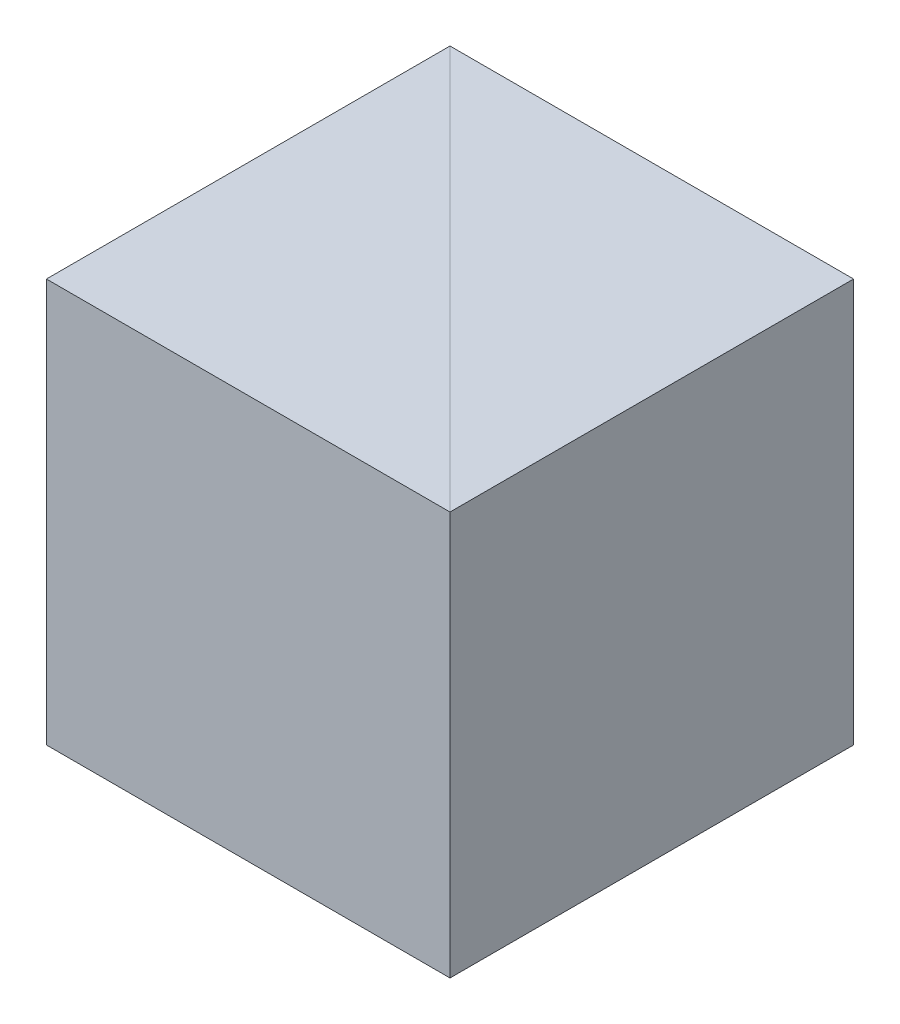
ISO-10303-21;
HEADER;
FILE_DESCRIPTION(('STEP AP214'),'2;1');
FILE_NAME('part.step','',(''),(''),'','','');
FILE_SCHEMA(('AUTOMOTIVE_DESIGN { 1 0 10303 214 1 1 1 1 }'));
ENDSEC;
DATA;
#1=APPLICATION_CONTEXT('core data for automotive mechanical design processes');
#2=APPLICATION_PROTOCOL_DEFINITION('international standard','automotive_design',2000,#1);
#3=PRODUCT_CONTEXT('',#1,'mechanical');
#4=PRODUCT('Part','Part','',(#3));
#5=PRODUCT_RELATED_PRODUCT_CATEGORY('part','',(#4));
#6=PRODUCT_DEFINITION_FORMATION('','',#4);
#7=PRODUCT_DEFINITION_CONTEXT('part definition',#1,'design');
#8=PRODUCT_DEFINITION('design','',#6,#7);
#9=PRODUCT_DEFINITION_SHAPE('','',#8);
#10=(LENGTH_UNIT() NAMED_UNIT(*) SI_UNIT(.MILLI.,.METRE.));
#11=(NAMED_UNIT(*) PLANE_ANGLE_UNIT() SI_UNIT($,.RADIAN.));
#12=(NAMED_UNIT(*) SI_UNIT($,.STERADIAN.) SOLID_ANGLE_UNIT());
#13=UNCERTAINTY_MEASURE_WITH_UNIT(LENGTH_MEASURE(1.E-05),#10,'distance_accuracy_value','');
#14=(GEOMETRIC_REPRESENTATION_CONTEXT(3) GLOBAL_UNCERTAINTY_ASSIGNED_CONTEXT((#13)) GLOBAL_UNIT_ASSIGNED_CONTEXT((#10,
#11,#12)) REPRESENTATION_CONTEXT('',''));
#15=CARTESIAN_POINT('',(0.,0.,0.));
#16=DIRECTION('',(0.,0.,1.));
#17=DIRECTION('',(1.,0.,0.));
#18=AXIS2_PLACEMENT_3D('',#15,#16,#17);
#19=CARTESIAN_POINT('',(0.,10.,0.));
#20=DIRECTION('',(0.707106781186547,0.,-0.707106781186548));
#21=DIRECTION('',(-0.707106781186548,0.,-0.707106781186547));
#22=AXIS2_PLACEMENT_3D('',#19,#20,#21);
#23=PLANE('',#22);
#24=DIRECTION('',(0.707106781186548,0.,0.707106781186547));
#25=VECTOR('',#24,1.);
#26=CARTESIAN_POINT('',(0.,0.,0.));
#27=LINE('',#26,#25);
#28=CARTESIAN_POINT('',(-10.,0.,-10.));
#29=VERTEX_POINT('',#28);
#30=CARTESIAN_POINT('',(0.,0.,0.));
#31=VERTEX_POINT('',#30);
#32=EDGE_CURVE('E97',#29,#31,#27,.T.);
#33=ORIENTED_EDGE('',*,*,#32,.F.);
#34=DIRECTION('',(0.,-1.,0.));
#35=VECTOR('',#34,1.);
#36=CARTESIAN_POINT('',(-10.,10.,-10.));
#37=LINE('',#36,#35);
#38=CARTESIAN_POINT('',(-10.,10.,-10.));
#39=VERTEX_POINT('',#38);
#40=EDGE_CURVE('E12',#39,#29,#37,.T.);
#41=ORIENTED_EDGE('',*,*,#40,.F.);
#42=DIRECTION('',(0.707106781186548,0.,0.707106781186547));
#43=VECTOR('',#42,1.);
#44=CARTESIAN_POINT('',(0.,10.,0.));
#45=LINE('',#44,#43);
#46=CARTESIAN_POINT('',(0.,10.,0.));
#47=VERTEX_POINT('',#46);
#48=EDGE_CURVE('E89',#39,#47,#45,.T.);
#49=ORIENTED_EDGE('',*,*,#48,.T.);
#50=DIRECTION('',(0.,-1.,0.));
#51=VECTOR('',#50,1.);
#52=CARTESIAN_POINT('',(0.,10.,0.));
#53=LINE('',#52,#51);
#54=EDGE_CURVE('E48',#47,#31,#53,.T.);
#55=ORIENTED_EDGE('',*,*,#54,.T.);
#56=EDGE_LOOP('',(#33,#41,#49,#55));
#57=FACE_BOUND('',#56,.T.);
#58=ADVANCED_FACE('F45',(#57),#23,.T.);
#59=CARTESIAN_POINT('',(-10.,10.,-10.));
#60=DIRECTION('',(-1.,0.,0.));
#61=DIRECTION('',(0.,0.,1.));
#62=AXIS2_PLACEMENT_3D('',#59,#60,#61);
#63=PLANE('',#62);
#64=DIRECTION('',(0.,0.,-1.));
#65=VECTOR('',#64,1.);
#66=CARTESIAN_POINT('',(-10.,0.,-10.));
#67=LINE('',#66,#65);
#68=CARTESIAN_POINT('',(-10.,0.,0.));
#69=VERTEX_POINT('',#68);
#70=EDGE_CURVE('E91',#69,#29,#67,.T.);
#71=ORIENTED_EDGE('',*,*,#70,.F.);
#72=DIRECTION('',(0.,-1.,0.));
#73=VECTOR('',#72,1.);
#74=CARTESIAN_POINT('',(-10.,10.,0.));
#75=LINE('',#74,#73);
#76=CARTESIAN_POINT('',(-10.,10.,0.));
#77=VERTEX_POINT('',#76);
#78=EDGE_CURVE('E54',#77,#69,#75,.T.);
#79=ORIENTED_EDGE('',*,*,#78,.F.);
#80=DIRECTION('',(0.,0.,-1.));
#81=VECTOR('',#80,1.);
#82=CARTESIAN_POINT('',(-10.,10.,-10.));
#83=LINE('',#82,#81);
#84=EDGE_CURVE('E86',#77,#39,#83,.T.);
#85=ORIENTED_EDGE('',*,*,#84,.T.);
#86=ORIENTED_EDGE('',*,*,#40,.T.);
#87=EDGE_LOOP('',(#71,#79,#85,#86));
#88=FACE_BOUND('',#87,.T.);
#89=ADVANCED_FACE('F101',(#88),#63,.T.);
#90=CARTESIAN_POINT('',(-10.,10.,0.));
#91=DIRECTION('',(0.,0.,1.));
#92=DIRECTION('',(1.,0.,0.));
#93=AXIS2_PLACEMENT_3D('',#90,#91,#92);
#94=PLANE('',#93);
#95=DIRECTION('',(-1.,0.,0.));
#96=VECTOR('',#95,1.);
#97=CARTESIAN_POINT('',(-10.,0.,0.));
#98=LINE('',#97,#96);
#99=EDGE_CURVE('E84',#31,#69,#98,.T.);
#100=ORIENTED_EDGE('',*,*,#99,.F.);
#101=ORIENTED_EDGE('',*,*,#54,.F.);
#102=DIRECTION('',(-1.,0.,0.));
#103=VECTOR('',#102,1.);
#104=CARTESIAN_POINT('',(-10.,10.,0.));
#105=LINE('',#104,#103);
#106=EDGE_CURVE('E82',#47,#77,#105,.T.);
#107=ORIENTED_EDGE('',*,*,#106,.T.);
#108=ORIENTED_EDGE('',*,*,#78,.T.);
#109=EDGE_LOOP('',(#100,#101,#107,#108));
#110=FACE_BOUND('',#109,.T.);
#111=ADVANCED_FACE('F81',(#110),#94,.T.);
#112=CARTESIAN_POINT('',(0.,10.,0.));
#113=DIRECTION('',(0.,1.,0.));
#114=DIRECTION('',(0.,0.,1.));
#115=AXIS2_PLACEMENT_3D('',#112,#113,#114);
#116=PLANE('',#115);
#117=ORIENTED_EDGE('',*,*,#48,.F.);
#118=ORIENTED_EDGE('',*,*,#84,.F.);
#119=ORIENTED_EDGE('',*,*,#106,.F.);
#120=EDGE_LOOP('',(#117,#118,#119));
#121=FACE_BOUND('',#120,.T.);
#122=ADVANCED_FACE('F88',(#121),#116,.T.);
#123=CARTESIAN_POINT('',(0.,0.,0.));
#124=DIRECTION('',(0.,1.,0.));
#125=DIRECTION('',(0.,0.,1.));
#126=AXIS2_PLACEMENT_3D('',#123,#124,#125);
#127=PLANE('',#126);
#128=ORIENTED_EDGE('',*,*,#32,.T.);
#129=ORIENTED_EDGE('',*,*,#99,.T.);
#130=ORIENTED_EDGE('',*,*,#70,.T.);
#131=EDGE_LOOP('',(#128,#129,#130));
#132=FACE_BOUND('',#131,.T.);
#133=ADVANCED_FACE('F100',(#132),#127,.F.);
#134=CLOSED_SHELL('',(#58,#89,#111,#122,#133));
#135=MANIFOLD_SOLID_BREP('B2',#134);
#136=CARTESIAN_POINT('',(-10.,10.,-10.));
#137=DIRECTION('',(0.707106781186547,0.,-0.707106781186548));
#138=DIRECTION('',(-0.707106781186548,0.,-0.707106781186547));
#139=AXIS2_PLACEMENT_3D('',#136,#137,#138);
#140=PLANE('',#139);
#141=DIRECTION('',(0.707106781186548,0.,0.707106781186547));
#142=VECTOR('',#141,1.);
#143=CARTESIAN_POINT('',(-10.,0.,-10.));
#144=LINE('',#143,#142);
#145=CARTESIAN_POINT('',(-10.,0.,-10.));
#146=VERTEX_POINT('',#145);
#147=CARTESIAN_POINT('',(0.,0.,0.));
#148=VERTEX_POINT('',#147);
#149=EDGE_CURVE('E190',#146,#148,#144,.T.);
#150=ORIENTED_EDGE('',*,*,#149,.T.);
#151=DIRECTION('',(0.,-1.,0.));
#152=VECTOR('',#151,1.);
#153=CARTESIAN_POINT('',(0.,10.,0.));
#154=LINE('',#153,#152);
#155=CARTESIAN_POINT('',(0.,10.,0.));
#156=VERTEX_POINT('',#155);
#157=EDGE_CURVE('E43',#156,#148,#154,.T.);
#158=ORIENTED_EDGE('',*,*,#157,.F.);
#159=DIRECTION('',(0.707106781186548,0.,0.707106781186547));
#160=VECTOR('',#159,1.);
#161=CARTESIAN_POINT('',(-10.,10.,-10.));
#162=LINE('',#161,#160);
#163=CARTESIAN_POINT('',(-10.,10.,-10.));
#164=VERTEX_POINT('',#163);
#165=EDGE_CURVE('E183',#164,#156,#162,.T.);
#166=ORIENTED_EDGE('',*,*,#165,.F.);
#167=DIRECTION('',(0.,-1.,0.));
#168=VECTOR('',#167,1.);
#169=CARTESIAN_POINT('',(-10.,10.,-10.));
#170=LINE('',#169,#168);
#171=EDGE_CURVE('E191',#164,#146,#170,.T.);
#172=ORIENTED_EDGE('',*,*,#171,.T.);
#173=EDGE_LOOP('',(#150,#158,#166,#172));
#174=FACE_BOUND('',#173,.T.);
#175=ADVANCED_FACE('F143',(#174),#140,.F.);
#176=CARTESIAN_POINT('',(0.,10.,0.));
#177=DIRECTION('',(-1.,0.,0.));
#178=DIRECTION('',(0.,0.,1.));
#179=AXIS2_PLACEMENT_3D('',#176,#177,#178);
#180=PLANE('',#179);
#181=DIRECTION('',(0.,0.,-1.));
#182=VECTOR('',#181,1.);
#183=CARTESIAN_POINT('',(0.,0.,0.));
#184=LINE('',#183,#182);
#185=CARTESIAN_POINT('',(0.,0.,-10.));
#186=VERTEX_POINT('',#185);
#187=EDGE_CURVE('E171',#148,#186,#184,.T.);
#188=ORIENTED_EDGE('',*,*,#187,.T.);
#189=DIRECTION('',(0.,-1.,0.));
#190=VECTOR('',#189,1.);
#191=CARTESIAN_POINT('',(0.,10.,-10.));
#192=LINE('',#191,#190);
#193=CARTESIAN_POINT('',(0.,10.,-10.));
#194=VERTEX_POINT('',#193);
#195=EDGE_CURVE('E151',#194,#186,#192,.T.);
#196=ORIENTED_EDGE('',*,*,#195,.F.);
#197=DIRECTION('',(0.,0.,-1.));
#198=VECTOR('',#197,1.);
#199=CARTESIAN_POINT('',(0.,10.,0.));
#200=LINE('',#199,#198);
#201=EDGE_CURVE('E179',#156,#194,#200,.T.);
#202=ORIENTED_EDGE('',*,*,#201,.F.);
#203=ORIENTED_EDGE('',*,*,#157,.T.);
#204=EDGE_LOOP('',(#188,#196,#202,#203));
#205=FACE_BOUND('',#204,.T.);
#206=ADVANCED_FACE('F180',(#205),#180,.F.);
#207=CARTESIAN_POINT('',(0.,10.,-10.));
#208=DIRECTION('',(0.,0.,1.));
#209=DIRECTION('',(1.,0.,0.));
#210=AXIS2_PLACEMENT_3D('',#207,#208,#209);
#211=PLANE('',#210);
#212=DIRECTION('',(-1.,0.,0.));
#213=VECTOR('',#212,1.);
#214=CARTESIAN_POINT('',(0.,0.,-10.));
#215=LINE('',#214,#213);
#216=EDGE_CURVE('E176',#186,#146,#215,.T.);
#217=ORIENTED_EDGE('',*,*,#216,.T.);
#218=ORIENTED_EDGE('',*,*,#171,.F.);
#219=DIRECTION('',(-1.,0.,0.));
#220=VECTOR('',#219,1.);
#221=CARTESIAN_POINT('',(0.,10.,-10.));
#222=LINE('',#221,#220);
#223=EDGE_CURVE('E159',#194,#164,#222,.T.);
#224=ORIENTED_EDGE('',*,*,#223,.F.);
#225=ORIENTED_EDGE('',*,*,#195,.T.);
#226=EDGE_LOOP('',(#217,#218,#224,#225));
#227=FACE_BOUND('',#226,.T.);
#228=ADVANCED_FACE('F198',(#227),#211,.F.);
#229=CARTESIAN_POINT('',(0.,10.,0.));
#230=DIRECTION('',(0.,1.,0.));
#231=DIRECTION('',(0.,0.,1.));
#232=AXIS2_PLACEMENT_3D('',#229,#230,#231);
#233=PLANE('',#232);
#234=ORIENTED_EDGE('',*,*,#165,.T.);
#235=ORIENTED_EDGE('',*,*,#201,.T.);
#236=ORIENTED_EDGE('',*,*,#223,.T.);
#237=EDGE_LOOP('',(#234,#235,#236));
#238=FACE_BOUND('',#237,.T.);
#239=ADVANCED_FACE('F186',(#238),#233,.T.);
#240=CARTESIAN_POINT('',(0.,0.,0.));
#241=DIRECTION('',(0.,1.,0.));
#242=DIRECTION('',(0.,0.,1.));
#243=AXIS2_PLACEMENT_3D('',#240,#241,#242);
#244=PLANE('',#243);
#245=ORIENTED_EDGE('',*,*,#149,.F.);
#246=ORIENTED_EDGE('',*,*,#216,.F.);
#247=ORIENTED_EDGE('',*,*,#187,.F.);
#248=EDGE_LOOP('',(#245,#246,#247));
#249=FACE_BOUND('',#248,.T.);
#250=ADVANCED_FACE('F199',(#249),#244,.F.);
#251=CLOSED_SHELL('',(#175,#206,#228,#239,#250));
#252=MANIFOLD_SOLID_BREP('B6',#251);
#253=ADVANCED_BREP_SHAPE_REPRESENTATION('',(#18,#135,#252),#14);
#254=SHAPE_DEFINITION_REPRESENTATION(#9,#253);
ENDSEC;
END-ISO-10303-21;
